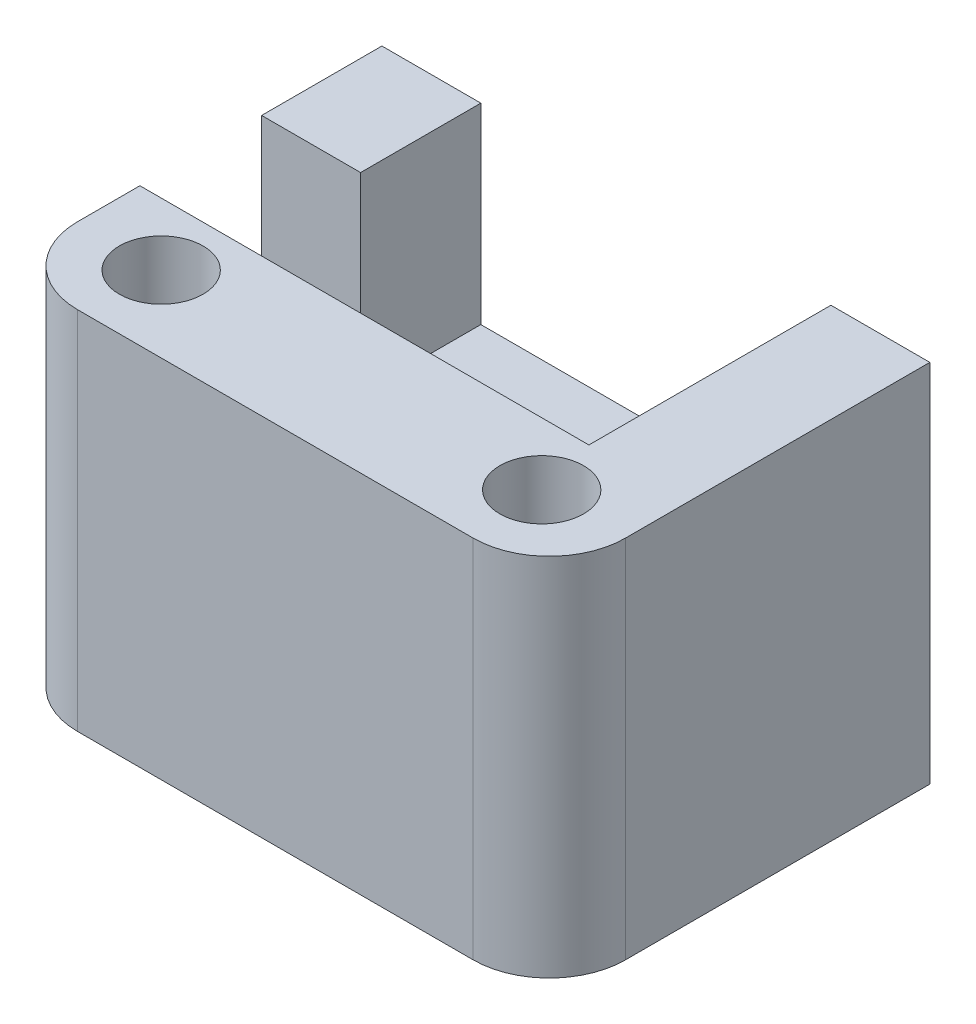
ISO-10303-21;
HEADER;
FILE_DESCRIPTION(('STEP AP214'),'2;1');
FILE_NAME('part.step','',(''),(''),'','','');
FILE_SCHEMA(('AUTOMOTIVE_DESIGN { 1 0 10303 214 1 1 1 1 }'));
ENDSEC;
DATA;
#1=APPLICATION_CONTEXT('core data for automotive mechanical design processes');
#2=APPLICATION_PROTOCOL_DEFINITION('international standard','automotive_design',2000,#1);
#3=PRODUCT_CONTEXT('',#1,'mechanical');
#4=PRODUCT('Part','Part','',(#3));
#5=PRODUCT_RELATED_PRODUCT_CATEGORY('part','',(#4));
#6=PRODUCT_DEFINITION_FORMATION('','',#4);
#7=PRODUCT_DEFINITION_CONTEXT('part definition',#1,'design');
#8=PRODUCT_DEFINITION('design','',#6,#7);
#9=PRODUCT_DEFINITION_SHAPE('','',#8);
#10=(LENGTH_UNIT() NAMED_UNIT(*) SI_UNIT(.MILLI.,.METRE.));
#11=(NAMED_UNIT(*) PLANE_ANGLE_UNIT() SI_UNIT($,.RADIAN.));
#12=(NAMED_UNIT(*) SI_UNIT($,.STERADIAN.) SOLID_ANGLE_UNIT());
#13=UNCERTAINTY_MEASURE_WITH_UNIT(LENGTH_MEASURE(1.E-05),#10,'distance_accuracy_value','');
#14=(GEOMETRIC_REPRESENTATION_CONTEXT(3) GLOBAL_UNCERTAINTY_ASSIGNED_CONTEXT((#13)) GLOBAL_UNIT_ASSIGNED_CONTEXT((#10,
#11,#12)) REPRESENTATION_CONTEXT('',''));
#15=CARTESIAN_POINT('',(0.,0.,0.));
#16=DIRECTION('',(0.,0.,1.));
#17=DIRECTION('',(1.,0.,0.));
#18=AXIS2_PLACEMENT_3D('',#15,#16,#17);
#19=CARTESIAN_POINT('',(0.,24.,0.));
#20=DIRECTION('',(0.,-1.,0.));
#21=DIRECTION('',(0.,0.,-1.));
#22=AXIS2_PLACEMENT_3D('',#19,#20,#21);
#23=PLANE('',#22);
#24=CARTESIAN_POINT('',(5.5,24.,-5.));
#25=DIRECTION('',(0.,1.,0.));
#26=DIRECTION('',(0.,0.,1.));
#27=AXIS2_PLACEMENT_3D('',#24,#25,#26);
#28=CIRCLE('',#27,2.75);
#29=CARTESIAN_POINT('',(5.5,24.,-2.25));
#30=VERTEX_POINT('',#29);
#31=EDGE_CURVE('E345',#30,#30,#28,.T.);
#32=ORIENTED_EDGE('',*,*,#31,.F.);
#33=EDGE_LOOP('',(#32));
#34=FACE_BOUND('',#33,.T.);
#35=CARTESIAN_POINT('',(30.5,24.,-5.));
#36=DIRECTION('',(0.,1.,0.));
#37=DIRECTION('',(0.,0.,1.));
#38=AXIS2_PLACEMENT_3D('',#35,#36,#37);
#39=CIRCLE('',#38,2.75);
#40=CARTESIAN_POINT('',(30.5,24.,-2.25));
#41=VERTEX_POINT('',#40);
#42=EDGE_CURVE('E333',#41,#41,#39,.T.);
#43=ORIENTED_EDGE('',*,*,#42,.F.);
#44=EDGE_LOOP('',(#43));
#45=FACE_BOUND('',#44,.T.);
#46=DIRECTION('',(0.,0.,1.));
#47=VECTOR('',#46,1.);
#48=CARTESIAN_POINT('',(0.,24.,0.));
#49=LINE('',#48,#47);
#50=CARTESIAN_POINT('',(0.,24.,-9.1));
#51=VERTEX_POINT('',#50);
#52=CARTESIAN_POINT('',(0.,24.,-5.));
#53=VERTEX_POINT('',#52);
#54=EDGE_CURVE('E143',#51,#53,#49,.T.);
#55=ORIENTED_EDGE('',*,*,#54,.T.);
#56=CARTESIAN_POINT('',(5.,24.,-5.));
#57=DIRECTION('',(0.,-1.,0.));
#58=DIRECTION('',(0.,0.,-1.));
#59=AXIS2_PLACEMENT_3D('',#56,#57,#58);
#60=CIRCLE('',#59,5.);
#61=CARTESIAN_POINT('',(5.,24.,0.));
#62=VERTEX_POINT('',#61);
#63=EDGE_CURVE('E12',#53,#62,#60,.F.);
#64=ORIENTED_EDGE('',*,*,#63,.T.);
#65=DIRECTION('',(1.,0.,0.));
#66=VECTOR('',#65,1.);
#67=CARTESIAN_POINT('',(0.,24.,0.));
#68=LINE('',#67,#66);
#69=CARTESIAN_POINT('',(31.,24.,0.));
#70=VERTEX_POINT('',#69);
#71=EDGE_CURVE('E166',#62,#70,#68,.T.);
#72=ORIENTED_EDGE('',*,*,#71,.T.);
#73=CARTESIAN_POINT('',(31.,24.,-5.));
#74=DIRECTION('',(0.,-1.,0.));
#75=DIRECTION('',(0.,0.,-1.));
#76=AXIS2_PLACEMENT_3D('',#73,#74,#75);
#77=CIRCLE('',#76,5.);
#78=CARTESIAN_POINT('',(36.,24.,-5.));
#79=VERTEX_POINT('',#78);
#80=EDGE_CURVE('E200',#70,#79,#77,.F.);
#81=ORIENTED_EDGE('',*,*,#80,.T.);
#82=DIRECTION('',(0.,0.,-1.));
#83=VECTOR('',#82,1.);
#84=CARTESIAN_POINT('',(36.,24.,0.));
#85=LINE('',#84,#83);
#86=CARTESIAN_POINT('',(36.,24.,-25.));
#87=VERTEX_POINT('',#86);
#88=EDGE_CURVE('E174',#79,#87,#85,.T.);
#89=ORIENTED_EDGE('',*,*,#88,.T.);
#90=DIRECTION('',(-1.,0.,0.));
#91=VECTOR('',#90,1.);
#92=CARTESIAN_POINT('',(0.,24.,-25.));
#93=LINE('',#92,#91);
#94=CARTESIAN_POINT('',(29.5,24.,-25.));
#95=VERTEX_POINT('',#94);
#96=EDGE_CURVE('E177',#87,#95,#93,.T.);
#97=ORIENTED_EDGE('',*,*,#96,.T.);
#98=DIRECTION('',(0.,0.,-1.));
#99=VECTOR('',#98,1.);
#100=CARTESIAN_POINT('',(29.5,24.,-25.));
#101=LINE('',#100,#99);
#102=CARTESIAN_POINT('',(29.5,24.,-9.1));
#103=VERTEX_POINT('',#102);
#104=EDGE_CURVE('E146',#103,#95,#101,.T.);
#105=ORIENTED_EDGE('',*,*,#104,.F.);
#106=DIRECTION('',(1.,0.,0.));
#107=VECTOR('',#106,1.);
#108=CARTESIAN_POINT('',(6.5,24.,-9.1));
#109=LINE('',#108,#107);
#110=EDGE_CURVE('E141',#51,#103,#109,.T.);
#111=ORIENTED_EDGE('',*,*,#110,.F.);
#112=EDGE_LOOP('',(#55,#64,#72,#81,#89,#97,#105,#111));
#113=FACE_BOUND('',#112,.T.);
#114=ADVANCED_FACE('F35',(#34,#45,#113),#23,.F.);
#115=CARTESIAN_POINT('',(0.,24.,0.));
#116=DIRECTION('',(1.,0.,0.));
#117=DIRECTION('',(0.,0.,-1.));
#118=AXIS2_PLACEMENT_3D('',#115,#116,#117);
#119=PLANE('',#118);
#120=DIRECTION('',(0.,0.,1.));
#121=VECTOR('',#120,1.);
#122=CARTESIAN_POINT('',(0.,0.,0.));
#123=LINE('',#122,#121);
#124=CARTESIAN_POINT('',(0.,0.,-25.));
#125=VERTEX_POINT('',#124);
#126=CARTESIAN_POINT('',(0.,0.,-5.));
#127=VERTEX_POINT('',#126);
#128=EDGE_CURVE('E180',#125,#127,#123,.T.);
#129=ORIENTED_EDGE('',*,*,#128,.T.);
#130=DIRECTION('',(0.,-1.,0.));
#131=VECTOR('',#130,1.);
#132=CARTESIAN_POINT('',(0.,24.,-5.));
#133=LINE('',#132,#131);
#134=EDGE_CURVE('E43',#127,#53,#133,.F.);
#135=ORIENTED_EDGE('',*,*,#134,.T.);
#136=ORIENTED_EDGE('',*,*,#54,.F.);
#137=DIRECTION('',(0.,1.,0.));
#138=VECTOR('',#137,1.);
#139=CARTESIAN_POINT('',(0.,24.,-9.1));
#140=LINE('',#139,#138);
#141=CARTESIAN_POINT('',(0.,14.,-9.1));
#142=VERTEX_POINT('',#141);
#143=EDGE_CURVE('E153',#142,#51,#140,.T.);
#144=ORIENTED_EDGE('',*,*,#143,.F.);
#145=DIRECTION('',(0.,0.,1.));
#146=VECTOR('',#145,1.);
#147=CARTESIAN_POINT('',(0.,14.,-9.1));
#148=LINE('',#147,#146);
#149=CARTESIAN_POINT('',(0.,14.,-17.1));
#150=VERTEX_POINT('',#149);
#151=EDGE_CURVE('E318',#150,#142,#148,.T.);
#152=ORIENTED_EDGE('',*,*,#151,.F.);
#153=DIRECTION('',(0.,-1.,0.));
#154=VECTOR('',#153,1.);
#155=CARTESIAN_POINT('',(0.,24.,-17.1));
#156=LINE('',#155,#154);
#157=CARTESIAN_POINT('',(0.,24.,-17.1));
#158=VERTEX_POINT('',#157);
#159=EDGE_CURVE('E159',#158,#150,#156,.T.);
#160=ORIENTED_EDGE('',*,*,#159,.F.);
#161=CARTESIAN_POINT('',(0.,24.,-25.));
#162=VERTEX_POINT('',#161);
#163=EDGE_CURVE('E162',#162,#158,#49,.T.);
#164=ORIENTED_EDGE('',*,*,#163,.F.);
#165=DIRECTION('',(0.,-1.,0.));
#166=VECTOR('',#165,1.);
#167=CARTESIAN_POINT('',(0.,24.,-25.));
#168=LINE('',#167,#166);
#169=EDGE_CURVE('E179',#162,#125,#168,.T.);
#170=ORIENTED_EDGE('',*,*,#169,.T.);
#171=EDGE_LOOP('',(#129,#135,#136,#144,#152,#160,#164,#170));
#172=FACE_BOUND('',#171,.T.);
#173=ADVANCED_FACE('F161',(#172),#119,.F.);
#174=CARTESIAN_POINT('',(0.,24.,0.));
#175=DIRECTION('',(0.,0.,-1.));
#176=DIRECTION('',(-1.,0.,0.));
#177=AXIS2_PLACEMENT_3D('',#174,#175,#176);
#178=PLANE('',#177);
#179=ORIENTED_EDGE('',*,*,#71,.F.);
#180=DIRECTION('',(0.,-1.,0.));
#181=VECTOR('',#180,1.);
#182=CARTESIAN_POINT('',(5.,24.,0.));
#183=LINE('',#182,#181);
#184=CARTESIAN_POINT('',(5.,0.,0.));
#185=VERTEX_POINT('',#184);
#186=EDGE_CURVE('E208',#62,#185,#183,.T.);
#187=ORIENTED_EDGE('',*,*,#186,.T.);
#188=DIRECTION('',(1.,0.,0.));
#189=VECTOR('',#188,1.);
#190=CARTESIAN_POINT('',(0.,0.,0.));
#191=LINE('',#190,#189);
#192=CARTESIAN_POINT('',(31.,0.,0.));
#193=VERTEX_POINT('',#192);
#194=EDGE_CURVE('E182',#185,#193,#191,.T.);
#195=ORIENTED_EDGE('',*,*,#194,.T.);
#196=DIRECTION('',(0.,-1.,0.));
#197=VECTOR('',#196,1.);
#198=CARTESIAN_POINT('',(31.,24.,0.));
#199=LINE('',#198,#197);
#200=EDGE_CURVE('E197',#193,#70,#199,.F.);
#201=ORIENTED_EDGE('',*,*,#200,.T.);
#202=EDGE_LOOP('',(#179,#187,#195,#201));
#203=FACE_BOUND('',#202,.T.);
#204=ADVANCED_FACE('F214',(#203),#178,.F.);
#205=CARTESIAN_POINT('',(36.,24.,0.));
#206=DIRECTION('',(-1.,0.,0.));
#207=DIRECTION('',(0.,0.,1.));
#208=AXIS2_PLACEMENT_3D('',#205,#206,#207);
#209=PLANE('',#208);
#210=ORIENTED_EDGE('',*,*,#88,.F.);
#211=DIRECTION('',(0.,-1.,0.));
#212=VECTOR('',#211,1.);
#213=CARTESIAN_POINT('',(36.,24.,-5.));
#214=LINE('',#213,#212);
#215=CARTESIAN_POINT('',(36.,0.,-5.));
#216=VERTEX_POINT('',#215);
#217=EDGE_CURVE('E191',#79,#216,#214,.T.);
#218=ORIENTED_EDGE('',*,*,#217,.T.);
#219=DIRECTION('',(0.,0.,-1.));
#220=VECTOR('',#219,1.);
#221=CARTESIAN_POINT('',(36.,0.,0.));
#222=LINE('',#221,#220);
#223=CARTESIAN_POINT('',(36.,0.,-25.));
#224=VERTEX_POINT('',#223);
#225=EDGE_CURVE('E167',#216,#224,#222,.T.);
#226=ORIENTED_EDGE('',*,*,#225,.T.);
#227=DIRECTION('',(0.,-1.,0.));
#228=VECTOR('',#227,1.);
#229=CARTESIAN_POINT('',(36.,24.,-25.));
#230=LINE('',#229,#228);
#231=EDGE_CURVE('E188',#87,#224,#230,.T.);
#232=ORIENTED_EDGE('',*,*,#231,.F.);
#233=EDGE_LOOP('',(#210,#218,#226,#232));
#234=FACE_BOUND('',#233,.T.);
#235=ADVANCED_FACE('F227',(#234),#209,.F.);
#236=CARTESIAN_POINT('',(0.,24.,-25.));
#237=DIRECTION('',(0.,0.,1.));
#238=DIRECTION('',(1.,0.,0.));
#239=AXIS2_PLACEMENT_3D('',#236,#237,#238);
#240=PLANE('',#239);
#241=CARTESIAN_POINT('',(32.5,17.7,-25.));
#242=DIRECTION('',(0.,0.,-1.));
#243=DIRECTION('',(-1.,0.,0.));
#244=AXIS2_PLACEMENT_3D('',#241,#242,#243);
#245=CIRCLE('',#244,1.025);
#246=CARTESIAN_POINT('',(31.475,17.7,-25.));
#247=VERTEX_POINT('',#246);
#248=EDGE_CURVE('E357',#247,#247,#245,.T.);
#249=ORIENTED_EDGE('',*,*,#248,.F.);
#250=EDGE_LOOP('',(#249));
#251=FACE_BOUND('',#250,.T.);
#252=CARTESIAN_POINT('',(3.5,17.7,-25.));
#253=DIRECTION('',(0.,0.,-1.));
#254=DIRECTION('',(-1.,0.,0.));
#255=AXIS2_PLACEMENT_3D('',#252,#253,#254);
#256=CIRCLE('',#255,1.025);
#257=CARTESIAN_POINT('',(2.475,17.7,-25.));
#258=VERTEX_POINT('',#257);
#259=EDGE_CURVE('E362',#258,#258,#256,.T.);
#260=ORIENTED_EDGE('',*,*,#259,.F.);
#261=EDGE_LOOP('',(#260));
#262=FACE_BOUND('',#261,.T.);
#263=CARTESIAN_POINT('',(6.5,24.,-25.));
#264=VERTEX_POINT('',#263);
#265=EDGE_CURVE('E176',#264,#162,#93,.T.);
#266=ORIENTED_EDGE('',*,*,#265,.F.);
#267=DIRECTION('',(0.,1.,0.));
#268=VECTOR('',#267,1.);
#269=CARTESIAN_POINT('',(6.5,11.4,-25.));
#270=LINE('',#269,#268);
#271=CARTESIAN_POINT('',(6.5,11.4,-25.));
#272=VERTEX_POINT('',#271);
#273=EDGE_CURVE('E183',#272,#264,#270,.T.);
#274=ORIENTED_EDGE('',*,*,#273,.F.);
#275=DIRECTION('',(-1.,0.,0.));
#276=VECTOR('',#275,1.);
#277=CARTESIAN_POINT('',(6.5,11.4,-25.));
#278=LINE('',#277,#276);
#279=CARTESIAN_POINT('',(29.5,11.4,-25.));
#280=VERTEX_POINT('',#279);
#281=EDGE_CURVE('E237',#280,#272,#278,.T.);
#282=ORIENTED_EDGE('',*,*,#281,.F.);
#283=DIRECTION('',(0.,1.,0.));
#284=VECTOR('',#283,1.);
#285=CARTESIAN_POINT('',(29.5,11.4,-25.));
#286=LINE('',#285,#284);
#287=EDGE_CURVE('E234',#280,#95,#286,.T.);
#288=ORIENTED_EDGE('',*,*,#287,.T.);
#289=ORIENTED_EDGE('',*,*,#96,.F.);
#290=ORIENTED_EDGE('',*,*,#231,.T.);
#291=DIRECTION('',(-1.,0.,0.));
#292=VECTOR('',#291,1.);
#293=CARTESIAN_POINT('',(0.,0.,-25.));
#294=LINE('',#293,#292);
#295=EDGE_CURVE('E163',#224,#125,#294,.T.);
#296=ORIENTED_EDGE('',*,*,#295,.T.);
#297=ORIENTED_EDGE('',*,*,#169,.F.);
#298=EDGE_LOOP('',(#266,#274,#282,#288,#289,#290,#296,#297));
#299=FACE_BOUND('',#298,.T.);
#300=ADVANCED_FACE('F232',(#251,#262,#299),#240,.F.);
#301=ORIENTED_EDGE('',*,*,#163,.T.);
#302=DIRECTION('',(-1.,0.,0.));
#303=VECTOR('',#302,1.);
#304=CARTESIAN_POINT('',(10.,24.,-17.1));
#305=LINE('',#304,#303);
#306=CARTESIAN_POINT('',(6.5,24.,-17.1));
#307=VERTEX_POINT('',#306);
#308=EDGE_CURVE('E314',#307,#158,#305,.T.);
#309=ORIENTED_EDGE('',*,*,#308,.F.);
#310=DIRECTION('',(0.,0.,1.));
#311=VECTOR('',#310,1.);
#312=CARTESIAN_POINT('',(6.5,24.,-25.));
#313=LINE('',#312,#311);
#314=EDGE_CURVE('E150',#264,#307,#313,.T.);
#315=ORIENTED_EDGE('',*,*,#314,.F.);
#316=ORIENTED_EDGE('',*,*,#265,.T.);
#317=EDGE_LOOP('',(#301,#309,#315,#316));
#318=FACE_BOUND('',#317,.T.);
#319=ADVANCED_FACE('F294',(#318),#23,.F.);
#320=CARTESIAN_POINT('',(0.,0.,0.));
#321=DIRECTION('',(0.,-1.,0.));
#322=DIRECTION('',(0.,0.,-1.));
#323=AXIS2_PLACEMENT_3D('',#320,#321,#322);
#324=PLANE('',#323);
#325=CARTESIAN_POINT('',(30.5,0.,-5.));
#326=DIRECTION('',(0.,1.,0.));
#327=DIRECTION('',(0.,0.,1.));
#328=AXIS2_PLACEMENT_3D('',#325,#326,#327);
#329=CIRCLE('',#328,1.49999999999999);
#330=CARTESIAN_POINT('',(30.5,0.,-3.50000000000001));
#331=VERTEX_POINT('',#330);
#332=EDGE_CURVE('E342',#331,#331,#329,.T.);
#333=ORIENTED_EDGE('',*,*,#332,.T.);
#334=EDGE_LOOP('',(#333));
#335=FACE_BOUND('',#334,.T.);
#336=CARTESIAN_POINT('',(5.5,0.,-5.));
#337=DIRECTION('',(0.,1.,0.));
#338=DIRECTION('',(0.,0.,1.));
#339=AXIS2_PLACEMENT_3D('',#336,#337,#338);
#340=CIRCLE('',#339,1.49999999999999);
#341=CARTESIAN_POINT('',(5.5,0.,-3.50000000000001));
#342=VERTEX_POINT('',#341);
#343=EDGE_CURVE('E354',#342,#342,#340,.T.);
#344=ORIENTED_EDGE('',*,*,#343,.T.);
#345=EDGE_LOOP('',(#344));
#346=FACE_BOUND('',#345,.T.);
#347=ORIENTED_EDGE('',*,*,#194,.F.);
#348=CARTESIAN_POINT('',(5.,0.,-5.));
#349=DIRECTION('',(0.,-1.,0.));
#350=DIRECTION('',(0.,0.,-1.));
#351=AXIS2_PLACEMENT_3D('',#348,#349,#350);
#352=CIRCLE('',#351,5.);
#353=EDGE_CURVE('E57',#185,#127,#352,.T.);
#354=ORIENTED_EDGE('',*,*,#353,.T.);
#355=ORIENTED_EDGE('',*,*,#128,.F.);
#356=ORIENTED_EDGE('',*,*,#295,.F.);
#357=ORIENTED_EDGE('',*,*,#225,.F.);
#358=CARTESIAN_POINT('',(31.,0.,-5.));
#359=DIRECTION('',(0.,-1.,0.));
#360=DIRECTION('',(0.,0.,-1.));
#361=AXIS2_PLACEMENT_3D('',#358,#359,#360);
#362=CIRCLE('',#361,5.);
#363=EDGE_CURVE('E194',#216,#193,#362,.T.);
#364=ORIENTED_EDGE('',*,*,#363,.T.);
#365=EDGE_LOOP('',(#347,#354,#355,#356,#357,#364));
#366=FACE_BOUND('',#365,.T.);
#367=ADVANCED_FACE('F216',(#335,#346,#366),#324,.T.);
#368=CARTESIAN_POINT('',(6.5,11.4,-25.));
#369=DIRECTION('',(-1.,0.,0.));
#370=DIRECTION('',(0.,0.,1.));
#371=AXIS2_PLACEMENT_3D('',#368,#369,#370);
#372=PLANE('',#371);
#373=DIRECTION('',(0.,-1.,0.));
#374=VECTOR('',#373,1.);
#375=CARTESIAN_POINT('',(6.5,11.4,-17.1));
#376=LINE('',#375,#374);
#377=CARTESIAN_POINT('',(6.5,14.,-17.1));
#378=VERTEX_POINT('',#377);
#379=EDGE_CURVE('E205',#307,#378,#376,.T.);
#380=ORIENTED_EDGE('',*,*,#379,.T.);
#381=DIRECTION('',(0.,0.,1.));
#382=VECTOR('',#381,1.);
#383=CARTESIAN_POINT('',(6.5,14.,-25.));
#384=LINE('',#383,#382);
#385=CARTESIAN_POINT('',(6.5,14.,-14.1));
#386=VERTEX_POINT('',#385);
#387=EDGE_CURVE('E330',#378,#386,#384,.T.);
#388=ORIENTED_EDGE('',*,*,#387,.T.);
#389=DIRECTION('',(0.,1.,0.));
#390=VECTOR('',#389,1.);
#391=CARTESIAN_POINT('',(6.5,11.4,-14.1));
#392=LINE('',#391,#390);
#393=CARTESIAN_POINT('',(6.5,11.4,-14.1));
#394=VERTEX_POINT('',#393);
#395=EDGE_CURVE('E171',#394,#386,#392,.T.);
#396=ORIENTED_EDGE('',*,*,#395,.F.);
#397=DIRECTION('',(0.,0.,1.));
#398=VECTOR('',#397,1.);
#399=CARTESIAN_POINT('',(6.5,11.4,-25.));
#400=LINE('',#399,#398);
#401=EDGE_CURVE('E266',#272,#394,#400,.T.);
#402=ORIENTED_EDGE('',*,*,#401,.F.);
#403=ORIENTED_EDGE('',*,*,#273,.T.);
#404=ORIENTED_EDGE('',*,*,#314,.T.);
#405=EDGE_LOOP('',(#380,#388,#396,#402,#403,#404));
#406=FACE_BOUND('',#405,.T.);
#407=ADVANCED_FACE('F280',(#406),#372,.F.);
#408=CARTESIAN_POINT('',(29.5,11.4,-25.));
#409=DIRECTION('',(1.,0.,0.));
#410=DIRECTION('',(0.,0.,-1.));
#411=AXIS2_PLACEMENT_3D('',#408,#409,#410);
#412=PLANE('',#411);
#413=ORIENTED_EDGE('',*,*,#104,.T.);
#414=ORIENTED_EDGE('',*,*,#287,.F.);
#415=DIRECTION('',(0.,0.,-1.));
#416=VECTOR('',#415,1.);
#417=CARTESIAN_POINT('',(29.5,11.4,-25.));
#418=LINE('',#417,#416);
#419=CARTESIAN_POINT('',(29.5,11.4,-9.1));
#420=VERTEX_POINT('',#419);
#421=EDGE_CURVE('E256',#420,#280,#418,.T.);
#422=ORIENTED_EDGE('',*,*,#421,.F.);
#423=DIRECTION('',(0.,1.,0.));
#424=VECTOR('',#423,1.);
#425=CARTESIAN_POINT('',(29.5,11.4,-9.1));
#426=LINE('',#425,#424);
#427=EDGE_CURVE('E241',#420,#103,#426,.T.);
#428=ORIENTED_EDGE('',*,*,#427,.T.);
#429=EDGE_LOOP('',(#413,#414,#422,#428));
#430=FACE_BOUND('',#429,.T.);
#431=ADVANCED_FACE('F278',(#430),#412,.F.);
#432=CARTESIAN_POINT('',(6.5,11.4,-9.1));
#433=DIRECTION('',(0.,0.,1.));
#434=DIRECTION('',(1.,0.,0.));
#435=AXIS2_PLACEMENT_3D('',#432,#433,#434);
#436=PLANE('',#435);
#437=DIRECTION('',(0.,1.,0.));
#438=VECTOR('',#437,1.);
#439=CARTESIAN_POINT('',(5.5,11.4,-9.1));
#440=LINE('',#439,#438);
#441=CARTESIAN_POINT('',(5.5,11.4,-9.1));
#442=VERTEX_POINT('',#441);
#443=CARTESIAN_POINT('',(5.5,14.,-9.1));
#444=VERTEX_POINT('',#443);
#445=EDGE_CURVE('E244',#442,#444,#440,.T.);
#446=ORIENTED_EDGE('',*,*,#445,.T.);
#447=DIRECTION('',(-1.,0.,0.));
#448=VECTOR('',#447,1.);
#449=CARTESIAN_POINT('',(10.,14.,-9.1));
#450=LINE('',#449,#448);
#451=EDGE_CURVE('E156',#444,#142,#450,.T.);
#452=ORIENTED_EDGE('',*,*,#451,.T.);
#453=ORIENTED_EDGE('',*,*,#143,.T.);
#454=ORIENTED_EDGE('',*,*,#110,.T.);
#455=ORIENTED_EDGE('',*,*,#427,.F.);
#456=DIRECTION('',(1.,0.,0.));
#457=VECTOR('',#456,1.);
#458=CARTESIAN_POINT('',(6.5,11.4,-9.1));
#459=LINE('',#458,#457);
#460=EDGE_CURVE('E260',#442,#420,#459,.T.);
#461=ORIENTED_EDGE('',*,*,#460,.F.);
#462=EDGE_LOOP('',(#446,#452,#453,#454,#455,#461));
#463=FACE_BOUND('',#462,.T.);
#464=ADVANCED_FACE('F155',(#463),#436,.F.);
#465=CARTESIAN_POINT('',(5.5,11.4,-9.1));
#466=DIRECTION('',(-1.,0.,0.));
#467=DIRECTION('',(0.,0.,1.));
#468=AXIS2_PLACEMENT_3D('',#465,#466,#467);
#469=PLANE('',#468);
#470=DIRECTION('',(0.,1.,0.));
#471=VECTOR('',#470,1.);
#472=CARTESIAN_POINT('',(5.5,11.4,-14.1));
#473=LINE('',#472,#471);
#474=CARTESIAN_POINT('',(5.5,11.4,-14.1));
#475=VERTEX_POINT('',#474);
#476=CARTESIAN_POINT('',(5.5,14.,-14.1));
#477=VERTEX_POINT('',#476);
#478=EDGE_CURVE('E248',#475,#477,#473,.T.);
#479=ORIENTED_EDGE('',*,*,#478,.T.);
#480=DIRECTION('',(0.,0.,1.));
#481=VECTOR('',#480,1.);
#482=CARTESIAN_POINT('',(5.5,14.,-9.1));
#483=LINE('',#482,#481);
#484=EDGE_CURVE('E325',#477,#444,#483,.T.);
#485=ORIENTED_EDGE('',*,*,#484,.T.);
#486=ORIENTED_EDGE('',*,*,#445,.F.);
#487=DIRECTION('',(0.,0.,1.));
#488=VECTOR('',#487,1.);
#489=CARTESIAN_POINT('',(5.5,11.4,-9.1));
#490=LINE('',#489,#488);
#491=EDGE_CURVE('E270',#475,#442,#490,.T.);
#492=ORIENTED_EDGE('',*,*,#491,.F.);
#493=EDGE_LOOP('',(#479,#485,#486,#492));
#494=FACE_BOUND('',#493,.T.);
#495=ADVANCED_FACE('F286',(#494),#469,.F.);
#496=CARTESIAN_POINT('',(6.5,11.4,-14.1));
#497=DIRECTION('',(0.,0.,-1.));
#498=DIRECTION('',(-1.,0.,0.));
#499=AXIS2_PLACEMENT_3D('',#496,#497,#498);
#500=PLANE('',#499);
#501=ORIENTED_EDGE('',*,*,#395,.T.);
#502=DIRECTION('',(-1.,0.,0.));
#503=VECTOR('',#502,1.);
#504=CARTESIAN_POINT('',(6.5,14.,-14.1));
#505=LINE('',#504,#503);
#506=EDGE_CURVE('E202',#386,#477,#505,.T.);
#507=ORIENTED_EDGE('',*,*,#506,.T.);
#508=ORIENTED_EDGE('',*,*,#478,.F.);
#509=DIRECTION('',(-1.,0.,0.));
#510=VECTOR('',#509,1.);
#511=CARTESIAN_POINT('',(6.5,11.4,-14.1));
#512=LINE('',#511,#510);
#513=EDGE_CURVE('E267',#394,#475,#512,.T.);
#514=ORIENTED_EDGE('',*,*,#513,.F.);
#515=EDGE_LOOP('',(#501,#507,#508,#514));
#516=FACE_BOUND('',#515,.T.);
#517=ADVANCED_FACE('F385',(#516),#500,.F.);
#518=CARTESIAN_POINT('',(0.,11.4,0.));
#519=DIRECTION('',(0.,-1.,0.));
#520=DIRECTION('',(0.,0.,-1.));
#521=AXIS2_PLACEMENT_3D('',#518,#519,#520);
#522=PLANE('',#521);
#523=ORIENTED_EDGE('',*,*,#401,.T.);
#524=ORIENTED_EDGE('',*,*,#513,.T.);
#525=ORIENTED_EDGE('',*,*,#491,.T.);
#526=ORIENTED_EDGE('',*,*,#460,.T.);
#527=ORIENTED_EDGE('',*,*,#421,.T.);
#528=ORIENTED_EDGE('',*,*,#281,.T.);
#529=EDGE_LOOP('',(#523,#524,#525,#526,#527,#528));
#530=FACE_BOUND('',#529,.T.);
#531=ADVANCED_FACE('F277',(#530),#522,.F.);
#532=CARTESIAN_POINT('',(3.5,17.7,-19.));
#533=DIRECTION('',(0.,0.,1.));
#534=DIRECTION('',(1.,0.,0.));
#535=AXIS2_PLACEMENT_3D('',#532,#533,#534);
#536=PLANE('',#535);
#537=CARTESIAN_POINT('',(3.5,17.7,-19.));
#538=DIRECTION('',(0.,0.,-1.));
#539=DIRECTION('',(-1.,0.,0.));
#540=AXIS2_PLACEMENT_3D('',#537,#538,#539);
#541=CIRCLE('',#540,1.025);
#542=CARTESIAN_POINT('',(2.475,17.7,-19.));
#543=VERTEX_POINT('',#542);
#544=EDGE_CURVE('E265',#543,#543,#541,.T.);
#545=ORIENTED_EDGE('',*,*,#544,.T.);
#546=EDGE_LOOP('',(#545));
#547=FACE_BOUND('',#546,.T.);
#548=ADVANCED_FACE('F369',(#547),#536,.F.);
#549=CARTESIAN_POINT('',(3.5,17.7,-25.));
#550=DIRECTION('',(0.,0.,-1.));
#551=DIRECTION('',(-1.,0.,0.));
#552=AXIS2_PLACEMENT_3D('',#549,#550,#551);
#553=CYLINDRICAL_SURFACE('',#552,1.025);
#554=ORIENTED_EDGE('',*,*,#544,.F.);
#555=EDGE_LOOP('',(#554));
#556=FACE_BOUND('',#555,.T.);
#557=ORIENTED_EDGE('',*,*,#259,.T.);
#558=EDGE_LOOP('',(#557));
#559=FACE_BOUND('',#558,.T.);
#560=ADVANCED_FACE('F371',(#556,#559),#553,.F.);
#561=CARTESIAN_POINT('',(32.5,17.7,-19.));
#562=DIRECTION('',(0.,0.,1.));
#563=DIRECTION('',(1.,0.,0.));
#564=AXIS2_PLACEMENT_3D('',#561,#562,#563);
#565=PLANE('',#564);
#566=CARTESIAN_POINT('',(32.5,17.7,-19.));
#567=DIRECTION('',(0.,0.,-1.));
#568=DIRECTION('',(-1.,0.,0.));
#569=AXIS2_PLACEMENT_3D('',#566,#567,#568);
#570=CIRCLE('',#569,1.025);
#571=CARTESIAN_POINT('',(31.475,17.7,-19.));
#572=VERTEX_POINT('',#571);
#573=EDGE_CURVE('E360',#572,#572,#570,.T.);
#574=ORIENTED_EDGE('',*,*,#573,.T.);
#575=EDGE_LOOP('',(#574));
#576=FACE_BOUND('',#575,.T.);
#577=ADVANCED_FACE('F373',(#576),#565,.F.);
#578=CARTESIAN_POINT('',(32.5,17.7,-25.));
#579=DIRECTION('',(0.,0.,-1.));
#580=DIRECTION('',(-1.,0.,0.));
#581=AXIS2_PLACEMENT_3D('',#578,#579,#580);
#582=CYLINDRICAL_SURFACE('',#581,1.025);
#583=ORIENTED_EDGE('',*,*,#573,.F.);
#584=EDGE_LOOP('',(#583));
#585=FACE_BOUND('',#584,.T.);
#586=ORIENTED_EDGE('',*,*,#248,.T.);
#587=EDGE_LOOP('',(#586));
#588=FACE_BOUND('',#587,.T.);
#589=ADVANCED_FACE('F379',(#585,#588),#582,.F.);
#590=CARTESIAN_POINT('',(31.,24.,-5.));
#591=DIRECTION('',(0.,-1.,0.));
#592=DIRECTION('',(0.,0.,-1.));
#593=AXIS2_PLACEMENT_3D('',#590,#591,#592);
#594=CYLINDRICAL_SURFACE('',#593,5.);
#595=ORIENTED_EDGE('',*,*,#80,.F.);
#596=ORIENTED_EDGE('',*,*,#200,.F.);
#597=ORIENTED_EDGE('',*,*,#363,.F.);
#598=ORIENTED_EDGE('',*,*,#217,.F.);
#599=EDGE_LOOP('',(#595,#596,#597,#598));
#600=FACE_BOUND('',#599,.T.);
#601=ADVANCED_FACE('F223',(#600),#594,.T.);
#602=CARTESIAN_POINT('',(5.5,24.,-5.));
#603=DIRECTION('',(0.,1.,0.));
#604=DIRECTION('',(0.,0.,1.));
#605=AXIS2_PLACEMENT_3D('',#602,#603,#604);
#606=CYLINDRICAL_SURFACE('',#605,1.5);
#607=ORIENTED_EDGE('',*,*,#343,.F.);
#608=EDGE_LOOP('',(#607));
#609=FACE_BOUND('',#608,.T.);
#610=CARTESIAN_POINT('',(5.5,20.,-5.));
#611=DIRECTION('',(0.,1.,0.));
#612=DIRECTION('',(0.,0.,1.));
#613=AXIS2_PLACEMENT_3D('',#610,#611,#612);
#614=CIRCLE('',#613,1.5);
#615=CARTESIAN_POINT('',(5.5,20.,-3.5));
#616=VERTEX_POINT('',#615);
#617=EDGE_CURVE('E351',#616,#616,#614,.T.);
#618=ORIENTED_EDGE('',*,*,#617,.T.);
#619=EDGE_LOOP('',(#618));
#620=FACE_BOUND('',#619,.T.);
#621=ADVANCED_FACE('F447',(#609,#620),#606,.F.);
#622=CARTESIAN_POINT('',(7.,20.,-5.));
#623=DIRECTION('',(0.,-1.,0.));
#624=DIRECTION('',(0.,0.,-1.));
#625=AXIS2_PLACEMENT_3D('',#622,#623,#624);
#626=PLANE('',#625);
#627=ORIENTED_EDGE('',*,*,#617,.F.);
#628=EDGE_LOOP('',(#627));
#629=FACE_BOUND('',#628,.T.);
#630=CARTESIAN_POINT('',(5.5,20.,-5.));
#631=DIRECTION('',(0.,1.,0.));
#632=DIRECTION('',(0.,0.,1.));
#633=AXIS2_PLACEMENT_3D('',#630,#631,#632);
#634=CIRCLE('',#633,2.75);
#635=CARTESIAN_POINT('',(5.5,20.,-2.25));
#636=VERTEX_POINT('',#635);
#637=EDGE_CURVE('E348',#636,#636,#634,.T.);
#638=ORIENTED_EDGE('',*,*,#637,.T.);
#639=EDGE_LOOP('',(#638));
#640=FACE_BOUND('',#639,.T.);
#641=ADVANCED_FACE('F490',(#629,#640),#626,.F.);
#642=CARTESIAN_POINT('',(5.5,24.,-5.));
#643=DIRECTION('',(0.,1.,0.));
#644=DIRECTION('',(0.,0.,1.));
#645=AXIS2_PLACEMENT_3D('',#642,#643,#644);
#646=CYLINDRICAL_SURFACE('',#645,2.75);
#647=ORIENTED_EDGE('',*,*,#637,.F.);
#648=EDGE_LOOP('',(#647));
#649=FACE_BOUND('',#648,.T.);
#650=ORIENTED_EDGE('',*,*,#31,.T.);
#651=EDGE_LOOP('',(#650));
#652=FACE_BOUND('',#651,.T.);
#653=ADVANCED_FACE('F480',(#649,#652),#646,.F.);
#654=CARTESIAN_POINT('',(30.5,24.,-5.));
#655=DIRECTION('',(0.,1.,0.));
#656=DIRECTION('',(0.,0.,1.));
#657=AXIS2_PLACEMENT_3D('',#654,#655,#656);
#658=CYLINDRICAL_SURFACE('',#657,1.5);
#659=ORIENTED_EDGE('',*,*,#332,.F.);
#660=EDGE_LOOP('',(#659));
#661=FACE_BOUND('',#660,.T.);
#662=CARTESIAN_POINT('',(30.5,20.,-5.));
#663=DIRECTION('',(0.,1.,0.));
#664=DIRECTION('',(0.,0.,1.));
#665=AXIS2_PLACEMENT_3D('',#662,#663,#664);
#666=CIRCLE('',#665,1.5);
#667=CARTESIAN_POINT('',(30.5,20.,-3.5));
#668=VERTEX_POINT('',#667);
#669=EDGE_CURVE('E339',#668,#668,#666,.T.);
#670=ORIENTED_EDGE('',*,*,#669,.T.);
#671=EDGE_LOOP('',(#670));
#672=FACE_BOUND('',#671,.T.);
#673=ADVANCED_FACE('F470',(#661,#672),#658,.F.);
#674=CARTESIAN_POINT('',(32.,20.,-5.));
#675=DIRECTION('',(0.,-1.,0.));
#676=DIRECTION('',(0.,0.,-1.));
#677=AXIS2_PLACEMENT_3D('',#674,#675,#676);
#678=PLANE('',#677);
#679=ORIENTED_EDGE('',*,*,#669,.F.);
#680=EDGE_LOOP('',(#679));
#681=FACE_BOUND('',#680,.T.);
#682=CARTESIAN_POINT('',(30.5,20.,-5.));
#683=DIRECTION('',(0.,1.,0.));
#684=DIRECTION('',(0.,0.,1.));
#685=AXIS2_PLACEMENT_3D('',#682,#683,#684);
#686=CIRCLE('',#685,2.75);
#687=CARTESIAN_POINT('',(30.5,20.,-2.25));
#688=VERTEX_POINT('',#687);
#689=EDGE_CURVE('E336',#688,#688,#686,.T.);
#690=ORIENTED_EDGE('',*,*,#689,.T.);
#691=EDGE_LOOP('',(#690));
#692=FACE_BOUND('',#691,.T.);
#693=ADVANCED_FACE('F459',(#681,#692),#678,.F.);
#694=CARTESIAN_POINT('',(30.5,24.,-5.));
#695=DIRECTION('',(0.,1.,0.));
#696=DIRECTION('',(0.,0.,1.));
#697=AXIS2_PLACEMENT_3D('',#694,#695,#696);
#698=CYLINDRICAL_SURFACE('',#697,2.75);
#699=ORIENTED_EDGE('',*,*,#689,.F.);
#700=EDGE_LOOP('',(#699));
#701=FACE_BOUND('',#700,.T.);
#702=ORIENTED_EDGE('',*,*,#42,.T.);
#703=EDGE_LOOP('',(#702));
#704=FACE_BOUND('',#703,.T.);
#705=ADVANCED_FACE('F453',(#701,#704),#698,.F.);
#706=CARTESIAN_POINT('',(10.,24.,-17.1));
#707=DIRECTION('',(0.,0.,-1.));
#708=DIRECTION('',(0.,1.,0.));
#709=AXIS2_PLACEMENT_3D('',#706,#707,#708);
#710=PLANE('',#709);
#711=ORIENTED_EDGE('',*,*,#308,.T.);
#712=ORIENTED_EDGE('',*,*,#159,.T.);
#713=DIRECTION('',(-1.,0.,0.));
#714=VECTOR('',#713,1.);
#715=CARTESIAN_POINT('',(10.,14.,-17.1));
#716=LINE('',#715,#714);
#717=EDGE_CURVE('E326',#378,#150,#716,.T.);
#718=ORIENTED_EDGE('',*,*,#717,.F.);
#719=ORIENTED_EDGE('',*,*,#379,.F.);
#720=EDGE_LOOP('',(#711,#712,#718,#719));
#721=FACE_BOUND('',#720,.T.);
#722=ADVANCED_FACE('F458',(#721),#710,.F.);
#723=CARTESIAN_POINT('',(10.,14.,-9.1));
#724=DIRECTION('',(0.,-1.,0.));
#725=DIRECTION('',(0.,0.,-1.));
#726=AXIS2_PLACEMENT_3D('',#723,#724,#725);
#727=PLANE('',#726);
#728=ORIENTED_EDGE('',*,*,#717,.T.);
#729=ORIENTED_EDGE('',*,*,#151,.T.);
#730=ORIENTED_EDGE('',*,*,#451,.F.);
#731=ORIENTED_EDGE('',*,*,#484,.F.);
#732=ORIENTED_EDGE('',*,*,#506,.F.);
#733=ORIENTED_EDGE('',*,*,#387,.F.);
#734=EDGE_LOOP('',(#728,#729,#730,#731,#732,#733));
#735=FACE_BOUND('',#734,.T.);
#736=ADVANCED_FACE('F512',(#735),#727,.F.);
#737=CARTESIAN_POINT('',(5.,24.,-5.));
#738=DIRECTION('',(0.,-1.,0.));
#739=DIRECTION('',(0.,0.,-1.));
#740=AXIS2_PLACEMENT_3D('',#737,#738,#739);
#741=CYLINDRICAL_SURFACE('',#740,5.);
#742=ORIENTED_EDGE('',*,*,#63,.F.);
#743=ORIENTED_EDGE('',*,*,#134,.F.);
#744=ORIENTED_EDGE('',*,*,#353,.F.);
#745=ORIENTED_EDGE('',*,*,#186,.F.);
#746=EDGE_LOOP('',(#742,#743,#744,#745));
#747=FACE_BOUND('',#746,.T.);
#748=ADVANCED_FACE('F37',(#747),#741,.T.);
#749=CLOSED_SHELL('',(#114,#173,#204,#235,#300,#319,#367,#407,#431,#464,#495,#517,#531,#548,
#560,#577,#589,#601,#621,#641,#653,#673,#693,#705,#722,#736,#748));
#750=MANIFOLD_SOLID_BREP('B2',#749);
#751=ADVANCED_BREP_SHAPE_REPRESENTATION('',(#18,#750),#14);
#752=SHAPE_DEFINITION_REPRESENTATION(#9,#751);
ENDSEC;
END-ISO-10303-21;
